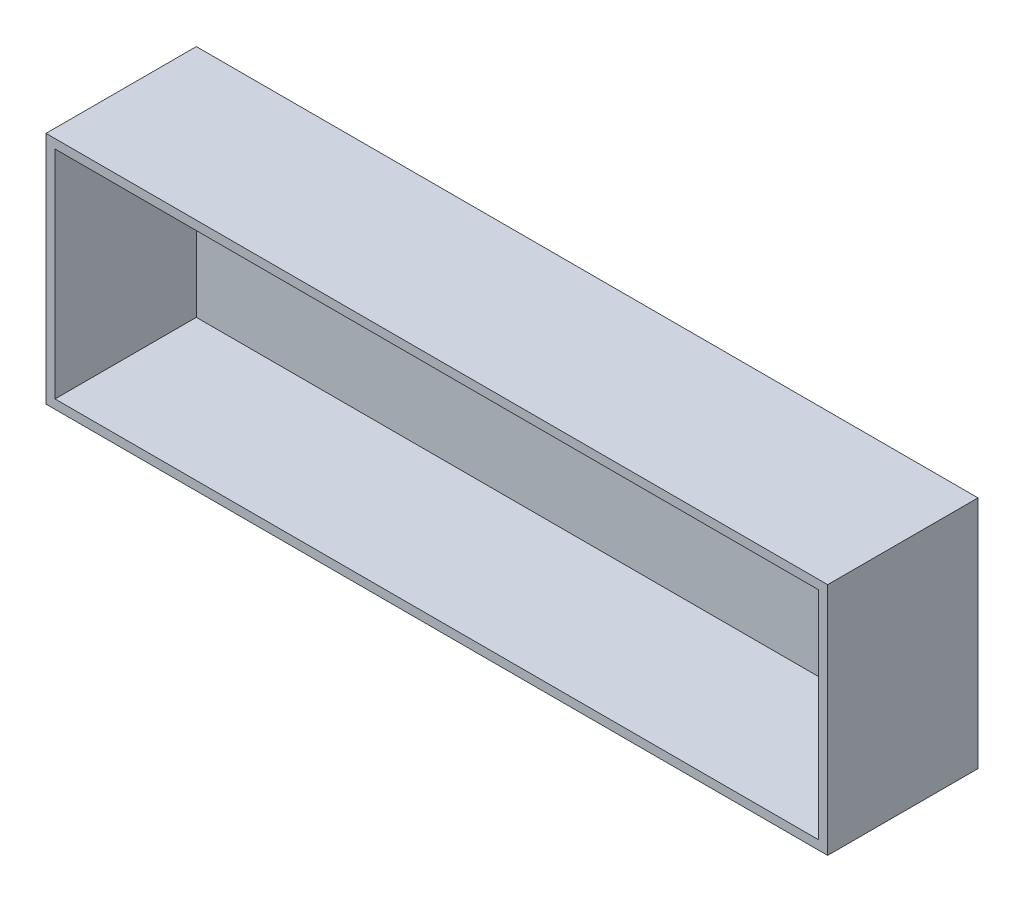
ISO-10303-21;
HEADER;
FILE_DESCRIPTION(('STEP AP214'),'2;1');
FILE_NAME('part.step','',(''),(''),'','','');
FILE_SCHEMA(('AUTOMOTIVE_DESIGN { 1 0 10303 214 1 1 1 1 }'));
ENDSEC;
DATA;
#1=APPLICATION_CONTEXT('core data for automotive mechanical design processes');
#2=APPLICATION_PROTOCOL_DEFINITION('international standard','automotive_design',2000,#1);
#3=PRODUCT_CONTEXT('',#1,'mechanical');
#4=PRODUCT('Part','Part','',(#3));
#5=PRODUCT_RELATED_PRODUCT_CATEGORY('part','',(#4));
#6=PRODUCT_DEFINITION_FORMATION('','',#4);
#7=PRODUCT_DEFINITION_CONTEXT('part definition',#1,'design');
#8=PRODUCT_DEFINITION('design','',#6,#7);
#9=PRODUCT_DEFINITION_SHAPE('','',#8);
#10=(LENGTH_UNIT() NAMED_UNIT(*) SI_UNIT(.MILLI.,.METRE.));
#11=(NAMED_UNIT(*) PLANE_ANGLE_UNIT() SI_UNIT($,.RADIAN.));
#12=(NAMED_UNIT(*) SI_UNIT($,.STERADIAN.) SOLID_ANGLE_UNIT());
#13=UNCERTAINTY_MEASURE_WITH_UNIT(LENGTH_MEASURE(1.E-05),#10,'distance_accuracy_value','');
#14=(GEOMETRIC_REPRESENTATION_CONTEXT(3) GLOBAL_UNCERTAINTY_ASSIGNED_CONTEXT((#13)) GLOBAL_UNIT_ASSIGNED_CONTEXT((#10,
#11,#12)) REPRESENTATION_CONTEXT('',''));
#15=CARTESIAN_POINT('',(0.,0.,0.));
#16=DIRECTION('',(0.,0.,1.));
#17=DIRECTION('',(1.,0.,0.));
#18=AXIS2_PLACEMENT_3D('',#15,#16,#17);
#19=CARTESIAN_POINT('',(130.,39.,50.));
#20=DIRECTION('',(-1.,0.,0.));
#21=DIRECTION('',(0.,0.,1.));
#22=AXIS2_PLACEMENT_3D('',#19,#20,#21);
#23=PLANE('',#22);
#24=DIRECTION('',(0.,1.,0.));
#25=VECTOR('',#24,1.);
#26=CARTESIAN_POINT('',(130.,39.,0.));
#27=LINE('',#26,#25);
#28=CARTESIAN_POINT('',(130.,-39.,0.));
#29=VERTEX_POINT('',#28);
#30=CARTESIAN_POINT('',(130.,39.,0.));
#31=VERTEX_POINT('',#30);
#32=EDGE_CURVE('E149',#29,#31,#27,.T.);
#33=ORIENTED_EDGE('',*,*,#32,.T.);
#34=DIRECTION('',(0.,0.,-1.));
#35=VECTOR('',#34,1.);
#36=CARTESIAN_POINT('',(130.,39.,50.));
#37=LINE('',#36,#35);
#38=CARTESIAN_POINT('',(130.,39.,50.));
#39=VERTEX_POINT('',#38);
#40=EDGE_CURVE('E11',#39,#31,#37,.T.);
#41=ORIENTED_EDGE('',*,*,#40,.F.);
#42=DIRECTION('',(0.,1.,0.));
#43=VECTOR('',#42,1.);
#44=CARTESIAN_POINT('',(130.,39.,50.));
#45=LINE('',#44,#43);
#46=CARTESIAN_POINT('',(130.,-39.,50.));
#47=VERTEX_POINT('',#46);
#48=EDGE_CURVE('E142',#47,#39,#45,.T.);
#49=ORIENTED_EDGE('',*,*,#48,.F.);
#50=DIRECTION('',(0.,0.,-1.));
#51=VECTOR('',#50,1.);
#52=CARTESIAN_POINT('',(130.,-39.,50.));
#53=LINE('',#52,#51);
#54=EDGE_CURVE('E148',#47,#29,#53,.T.);
#55=ORIENTED_EDGE('',*,*,#54,.T.);
#56=EDGE_LOOP('',(#33,#41,#49,#55));
#57=FACE_BOUND('',#56,.T.);
#58=ADVANCED_FACE('F35',(#57),#23,.F.);
#59=CARTESIAN_POINT('',(-130.,39.,50.));
#60=DIRECTION('',(0.,-1.,0.));
#61=DIRECTION('',(0.,0.,-1.));
#62=AXIS2_PLACEMENT_3D('',#59,#60,#61);
#63=PLANE('',#62);
#64=DIRECTION('',(-1.,0.,0.));
#65=VECTOR('',#64,1.);
#66=CARTESIAN_POINT('',(-130.,39.,0.));
#67=LINE('',#66,#65);
#68=CARTESIAN_POINT('',(-130.,39.,0.));
#69=VERTEX_POINT('',#68);
#70=EDGE_CURVE('E152',#31,#69,#67,.T.);
#71=ORIENTED_EDGE('',*,*,#70,.T.);
#72=DIRECTION('',(0.,0.,-1.));
#73=VECTOR('',#72,1.);
#74=CARTESIAN_POINT('',(-130.,39.,50.));
#75=LINE('',#74,#73);
#76=CARTESIAN_POINT('',(-130.,39.,50.));
#77=VERTEX_POINT('',#76);
#78=EDGE_CURVE('E42',#77,#69,#75,.T.);
#79=ORIENTED_EDGE('',*,*,#78,.F.);
#80=DIRECTION('',(-1.,0.,0.));
#81=VECTOR('',#80,1.);
#82=CARTESIAN_POINT('',(-130.,39.,50.));
#83=LINE('',#82,#81);
#84=EDGE_CURVE('E86',#39,#77,#83,.T.);
#85=ORIENTED_EDGE('',*,*,#84,.F.);
#86=ORIENTED_EDGE('',*,*,#40,.T.);
#87=EDGE_LOOP('',(#71,#79,#85,#86));
#88=FACE_BOUND('',#87,.T.);
#89=ADVANCED_FACE('F181',(#88),#63,.F.);
#90=CARTESIAN_POINT('',(-130.,39.,50.));
#91=DIRECTION('',(1.,0.,0.));
#92=DIRECTION('',(0.,0.,-1.));
#93=AXIS2_PLACEMENT_3D('',#90,#91,#92);
#94=PLANE('',#93);
#95=DIRECTION('',(0.,-1.,0.));
#96=VECTOR('',#95,1.);
#97=CARTESIAN_POINT('',(-130.,39.,0.));
#98=LINE('',#97,#96);
#99=CARTESIAN_POINT('',(-130.,-39.,0.));
#100=VERTEX_POINT('',#99);
#101=EDGE_CURVE('E154',#69,#100,#98,.T.);
#102=ORIENTED_EDGE('',*,*,#101,.T.);
#103=DIRECTION('',(0.,0.,-1.));
#104=VECTOR('',#103,1.);
#105=CARTESIAN_POINT('',(-130.,-39.,50.));
#106=LINE('',#105,#104);
#107=CARTESIAN_POINT('',(-130.,-39.,50.));
#108=VERTEX_POINT('',#107);
#109=EDGE_CURVE('E158',#108,#100,#106,.T.);
#110=ORIENTED_EDGE('',*,*,#109,.F.);
#111=DIRECTION('',(0.,-1.,0.));
#112=VECTOR('',#111,1.);
#113=CARTESIAN_POINT('',(-130.,39.,50.));
#114=LINE('',#113,#112);
#115=EDGE_CURVE('E145',#77,#108,#114,.T.);
#116=ORIENTED_EDGE('',*,*,#115,.F.);
#117=ORIENTED_EDGE('',*,*,#78,.T.);
#118=EDGE_LOOP('',(#102,#110,#116,#117));
#119=FACE_BOUND('',#118,.T.);
#120=ADVANCED_FACE('F163',(#119),#94,.F.);
#121=CARTESIAN_POINT('',(-130.,-39.,50.));
#122=DIRECTION('',(0.,1.,0.));
#123=DIRECTION('',(0.,0.,1.));
#124=AXIS2_PLACEMENT_3D('',#121,#122,#123);
#125=PLANE('',#124);
#126=DIRECTION('',(1.,0.,0.));
#127=VECTOR('',#126,1.);
#128=CARTESIAN_POINT('',(-130.,-39.,0.));
#129=LINE('',#128,#127);
#130=EDGE_CURVE('E79',#100,#29,#129,.T.);
#131=ORIENTED_EDGE('',*,*,#130,.T.);
#132=ORIENTED_EDGE('',*,*,#54,.F.);
#133=DIRECTION('',(1.,0.,0.));
#134=VECTOR('',#133,1.);
#135=CARTESIAN_POINT('',(-130.,-39.,50.));
#136=LINE('',#135,#134);
#137=EDGE_CURVE('E58',#108,#47,#136,.T.);
#138=ORIENTED_EDGE('',*,*,#137,.F.);
#139=ORIENTED_EDGE('',*,*,#109,.T.);
#140=EDGE_LOOP('',(#131,#132,#138,#139));
#141=FACE_BOUND('',#140,.T.);
#142=ADVANCED_FACE('F171',(#141),#125,.F.);
#143=CARTESIAN_POINT('',(0.,0.,50.));
#144=DIRECTION('',(0.,0.,1.));
#145=DIRECTION('',(1.,0.,0.));
#146=AXIS2_PLACEMENT_3D('',#143,#144,#145);
#147=PLANE('',#146);
#148=DIRECTION('',(0.,1.,0.));
#149=VECTOR('',#148,1.);
#150=CARTESIAN_POINT('',(127.,39.,50.));
#151=LINE('',#150,#149);
#152=CARTESIAN_POINT('',(127.,-36.,50.));
#153=VERTEX_POINT('',#152);
#154=CARTESIAN_POINT('',(127.,36.,50.));
#155=VERTEX_POINT('',#154);
#156=EDGE_CURVE('E131',#153,#155,#151,.T.);
#157=ORIENTED_EDGE('',*,*,#156,.F.);
#158=DIRECTION('',(1.,0.,0.));
#159=VECTOR('',#158,1.);
#160=CARTESIAN_POINT('',(-130.,-36.,50.));
#161=LINE('',#160,#159);
#162=CARTESIAN_POINT('',(-127.,-36.,50.));
#163=VERTEX_POINT('',#162);
#164=EDGE_CURVE('E140',#163,#153,#161,.T.);
#165=ORIENTED_EDGE('',*,*,#164,.F.);
#166=DIRECTION('',(0.,-1.,0.));
#167=VECTOR('',#166,1.);
#168=CARTESIAN_POINT('',(-127.,39.,50.));
#169=LINE('',#168,#167);
#170=CARTESIAN_POINT('',(-127.,36.,50.));
#171=VERTEX_POINT('',#170);
#172=EDGE_CURVE('E138',#171,#163,#169,.T.);
#173=ORIENTED_EDGE('',*,*,#172,.F.);
#174=DIRECTION('',(-1.,0.,0.));
#175=VECTOR('',#174,1.);
#176=CARTESIAN_POINT('',(-130.,36.,50.));
#177=LINE('',#176,#175);
#178=EDGE_CURVE('E123',#155,#171,#177,.T.);
#179=ORIENTED_EDGE('',*,*,#178,.F.);
#180=EDGE_LOOP('',(#157,#165,#173,#179));
#181=FACE_BOUND('',#180,.T.);
#182=ORIENTED_EDGE('',*,*,#48,.T.);
#183=ORIENTED_EDGE('',*,*,#84,.T.);
#184=ORIENTED_EDGE('',*,*,#115,.T.);
#185=ORIENTED_EDGE('',*,*,#137,.T.);
#186=EDGE_LOOP('',(#182,#183,#184,#185));
#187=FACE_BOUND('',#186,.T.);
#188=ADVANCED_FACE('F173',(#181,#187),#147,.T.);
#189=CARTESIAN_POINT('',(0.,0.,0.));
#190=DIRECTION('',(0.,0.,1.));
#191=DIRECTION('',(1.,0.,0.));
#192=AXIS2_PLACEMENT_3D('',#189,#190,#191);
#193=PLANE('',#192);
#194=ORIENTED_EDGE('',*,*,#32,.F.);
#195=ORIENTED_EDGE('',*,*,#130,.F.);
#196=ORIENTED_EDGE('',*,*,#101,.F.);
#197=ORIENTED_EDGE('',*,*,#70,.F.);
#198=EDGE_LOOP('',(#194,#195,#196,#197));
#199=FACE_BOUND('',#198,.T.);
#200=ADVANCED_FACE('F167',(#199),#193,.F.);
#201=CARTESIAN_POINT('',(127.,39.,50.));
#202=DIRECTION('',(-1.,0.,0.));
#203=DIRECTION('',(0.,0.,1.));
#204=AXIS2_PLACEMENT_3D('',#201,#202,#203);
#205=PLANE('',#204);
#206=DIRECTION('',(0.,1.,0.));
#207=VECTOR('',#206,1.);
#208=CARTESIAN_POINT('',(127.,39.,3.));
#209=LINE('',#208,#207);
#210=CARTESIAN_POINT('',(127.,-36.,3.));
#211=VERTEX_POINT('',#210);
#212=CARTESIAN_POINT('',(127.,36.,3.));
#213=VERTEX_POINT('',#212);
#214=EDGE_CURVE('E114',#211,#213,#209,.T.);
#215=ORIENTED_EDGE('',*,*,#214,.F.);
#216=DIRECTION('',(0.,0.,-1.));
#217=VECTOR('',#216,1.);
#218=CARTESIAN_POINT('',(127.,-36.,50.));
#219=LINE('',#218,#217);
#220=EDGE_CURVE('E134',#153,#211,#219,.T.);
#221=ORIENTED_EDGE('',*,*,#220,.F.);
#222=ORIENTED_EDGE('',*,*,#156,.T.);
#223=DIRECTION('',(0.,0.,-1.));
#224=VECTOR('',#223,1.);
#225=CARTESIAN_POINT('',(127.,36.,50.));
#226=LINE('',#225,#224);
#227=EDGE_CURVE('E126',#155,#213,#226,.T.);
#228=ORIENTED_EDGE('',*,*,#227,.T.);
#229=EDGE_LOOP('',(#215,#221,#222,#228));
#230=FACE_BOUND('',#229,.T.);
#231=ADVANCED_FACE('F208',(#230),#205,.T.);
#232=CARTESIAN_POINT('',(-130.,36.,50.));
#233=DIRECTION('',(0.,-1.,0.));
#234=DIRECTION('',(0.,0.,-1.));
#235=AXIS2_PLACEMENT_3D('',#232,#233,#234);
#236=PLANE('',#235);
#237=DIRECTION('',(-1.,0.,0.));
#238=VECTOR('',#237,1.);
#239=CARTESIAN_POINT('',(-130.,36.,3.));
#240=LINE('',#239,#238);
#241=CARTESIAN_POINT('',(-127.,36.,3.));
#242=VERTEX_POINT('',#241);
#243=EDGE_CURVE('E108',#213,#242,#240,.T.);
#244=ORIENTED_EDGE('',*,*,#243,.F.);
#245=ORIENTED_EDGE('',*,*,#227,.F.);
#246=ORIENTED_EDGE('',*,*,#178,.T.);
#247=DIRECTION('',(0.,0.,-1.));
#248=VECTOR('',#247,1.);
#249=CARTESIAN_POINT('',(-127.,36.,50.));
#250=LINE('',#249,#248);
#251=EDGE_CURVE('E120',#171,#242,#250,.T.);
#252=ORIENTED_EDGE('',*,*,#251,.T.);
#253=EDGE_LOOP('',(#244,#245,#246,#252));
#254=FACE_BOUND('',#253,.T.);
#255=ADVANCED_FACE('F121',(#254),#236,.T.);
#256=CARTESIAN_POINT('',(-127.,39.,50.));
#257=DIRECTION('',(1.,0.,0.));
#258=DIRECTION('',(0.,0.,-1.));
#259=AXIS2_PLACEMENT_3D('',#256,#257,#258);
#260=PLANE('',#259);
#261=DIRECTION('',(0.,-1.,0.));
#262=VECTOR('',#261,1.);
#263=CARTESIAN_POINT('',(-127.,39.,3.));
#264=LINE('',#263,#262);
#265=CARTESIAN_POINT('',(-127.,-36.,3.));
#266=VERTEX_POINT('',#265);
#267=EDGE_CURVE('E112',#242,#266,#264,.T.);
#268=ORIENTED_EDGE('',*,*,#267,.F.);
#269=ORIENTED_EDGE('',*,*,#251,.F.);
#270=ORIENTED_EDGE('',*,*,#172,.T.);
#271=DIRECTION('',(0.,0.,-1.));
#272=VECTOR('',#271,1.);
#273=CARTESIAN_POINT('',(-127.,-36.,50.));
#274=LINE('',#273,#272);
#275=EDGE_CURVE('E49',#163,#266,#274,.T.);
#276=ORIENTED_EDGE('',*,*,#275,.T.);
#277=EDGE_LOOP('',(#268,#269,#270,#276));
#278=FACE_BOUND('',#277,.T.);
#279=ADVANCED_FACE('F128',(#278),#260,.T.);
#280=CARTESIAN_POINT('',(-130.,-36.,50.));
#281=DIRECTION('',(0.,1.,0.));
#282=DIRECTION('',(0.,0.,1.));
#283=AXIS2_PLACEMENT_3D('',#280,#281,#282);
#284=PLANE('',#283);
#285=DIRECTION('',(1.,0.,0.));
#286=VECTOR('',#285,1.);
#287=CARTESIAN_POINT('',(-130.,-36.,3.));
#288=LINE('',#287,#286);
#289=EDGE_CURVE('E129',#266,#211,#288,.T.);
#290=ORIENTED_EDGE('',*,*,#289,.F.);
#291=ORIENTED_EDGE('',*,*,#275,.F.);
#292=ORIENTED_EDGE('',*,*,#164,.T.);
#293=ORIENTED_EDGE('',*,*,#220,.T.);
#294=EDGE_LOOP('',(#290,#291,#292,#293));
#295=FACE_BOUND('',#294,.T.);
#296=ADVANCED_FACE('F238',(#295),#284,.T.);
#297=CARTESIAN_POINT('',(0.,0.,3.));
#298=DIRECTION('',(0.,0.,1.));
#299=DIRECTION('',(1.,0.,0.));
#300=AXIS2_PLACEMENT_3D('',#297,#298,#299);
#301=PLANE('',#300);
#302=ORIENTED_EDGE('',*,*,#214,.T.);
#303=ORIENTED_EDGE('',*,*,#243,.T.);
#304=ORIENTED_EDGE('',*,*,#267,.T.);
#305=ORIENTED_EDGE('',*,*,#289,.T.);
#306=EDGE_LOOP('',(#302,#303,#304,#305));
#307=FACE_BOUND('',#306,.T.);
#308=ADVANCED_FACE('F110',(#307),#301,.T.);
#309=CLOSED_SHELL('',(#58,#89,#120,#142,#188,#200,#231,#255,#279,#296,#308));
#310=MANIFOLD_SOLID_BREP('B2',#309);
#311=ADVANCED_BREP_SHAPE_REPRESENTATION('',(#18,#310),#14);
#312=SHAPE_DEFINITION_REPRESENTATION(#9,#311);
ENDSEC;
END-ISO-10303-21;
